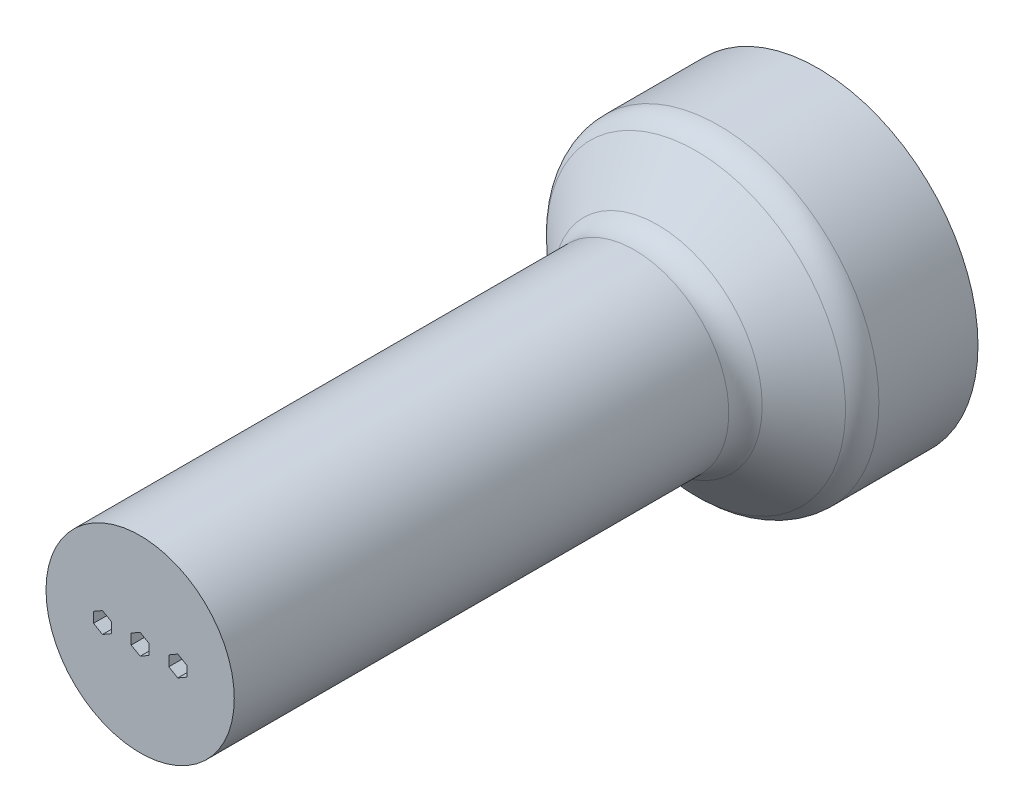
ISO-10303-21;
HEADER;
FILE_DESCRIPTION(('STEP AP214'),'2;1');
FILE_NAME('part.step','',(''),(''),'','','');
FILE_SCHEMA(('AUTOMOTIVE_DESIGN { 1 0 10303 214 1 1 1 1 }'));
ENDSEC;
DATA;
#1=APPLICATION_CONTEXT('core data for automotive mechanical design processes');
#2=APPLICATION_PROTOCOL_DEFINITION('international standard','automotive_design',2000,#1);
#3=PRODUCT_CONTEXT('',#1,'mechanical');
#4=PRODUCT('Part','Part','',(#3));
#5=PRODUCT_RELATED_PRODUCT_CATEGORY('part','',(#4));
#6=PRODUCT_DEFINITION_FORMATION('','',#4);
#7=PRODUCT_DEFINITION_CONTEXT('part definition',#1,'design');
#8=PRODUCT_DEFINITION('design','',#6,#7);
#9=PRODUCT_DEFINITION_SHAPE('','',#8);
#10=(LENGTH_UNIT() NAMED_UNIT(*) SI_UNIT(.MILLI.,.METRE.));
#11=(NAMED_UNIT(*) PLANE_ANGLE_UNIT() SI_UNIT($,.RADIAN.));
#12=(NAMED_UNIT(*) SI_UNIT($,.STERADIAN.) SOLID_ANGLE_UNIT());
#13=UNCERTAINTY_MEASURE_WITH_UNIT(LENGTH_MEASURE(1.E-05),#10,'distance_accuracy_value','');
#14=(GEOMETRIC_REPRESENTATION_CONTEXT(3) GLOBAL_UNCERTAINTY_ASSIGNED_CONTEXT((#13)) GLOBAL_UNIT_ASSIGNED_CONTEXT((#10,
#11,#12)) REPRESENTATION_CONTEXT('',''));
#15=CARTESIAN_POINT('',(0.,0.,0.));
#16=DIRECTION('',(0.,0.,1.));
#17=DIRECTION('',(1.,0.,0.));
#18=AXIS2_PLACEMENT_3D('',#15,#16,#17);
#19=CARTESIAN_POINT('',(0.,0.,-30.));
#20=DIRECTION('',(0.,0.,1.));
#21=DIRECTION('',(1.,0.,0.));
#22=AXIS2_PLACEMENT_3D('',#19,#20,#21);
#23=PLANE('',#22);
#24=CARTESIAN_POINT('',(-30.,0.,-30.));
#25=DIRECTION('',(0.,0.,-1.));
#26=DIRECTION('',(-1.,0.,0.));
#27=AXIS2_PLACEMENT_3D('',#24,#25,#26);
#28=CIRCLE('',#27,10.);
#29=CARTESIAN_POINT('',(-40.,0.,-30.));
#30=VERTEX_POINT('',#29);
#31=EDGE_CURVE('E460',#30,#30,#28,.T.);
#32=ORIENTED_EDGE('',*,*,#31,.F.);
#33=EDGE_LOOP('',(#32));
#34=FACE_BOUND('',#33,.T.);
#35=CARTESIAN_POINT('',(10.,0.,-30.));
#36=DIRECTION('',(0.,0.,1.));
#37=DIRECTION('',(1.,0.,0.));
#38=AXIS2_PLACEMENT_3D('',#35,#36,#37);
#39=CIRCLE('',#38,1.6);
#40=CARTESIAN_POINT('',(11.6,0.,-30.));
#41=VERTEX_POINT('',#40);
#42=EDGE_CURVE('E359',#41,#41,#39,.F.);
#43=ORIENTED_EDGE('',*,*,#42,.F.);
#44=EDGE_LOOP('',(#43));
#45=FACE_BOUND('',#44,.T.);
#46=CARTESIAN_POINT('',(-10.,0.,-30.));
#47=DIRECTION('',(0.,0.,1.));
#48=DIRECTION('',(1.,0.,0.));
#49=AXIS2_PLACEMENT_3D('',#46,#47,#48);
#50=CIRCLE('',#49,1.6);
#51=CARTESIAN_POINT('',(-8.4,0.,-30.));
#52=VERTEX_POINT('',#51);
#53=EDGE_CURVE('E354',#52,#52,#50,.F.);
#54=ORIENTED_EDGE('',*,*,#53,.F.);
#55=EDGE_LOOP('',(#54));
#56=FACE_BOUND('',#55,.T.);
#57=CARTESIAN_POINT('',(0.,0.,-30.));
#58=DIRECTION('',(0.,0.,1.));
#59=DIRECTION('',(1.,0.,0.));
#60=AXIS2_PLACEMENT_3D('',#57,#58,#59);
#61=CIRCLE('',#60,1.6);
#62=CARTESIAN_POINT('',(1.6,0.,-30.));
#63=VERTEX_POINT('',#62);
#64=EDGE_CURVE('E358',#63,#63,#61,.F.);
#65=ORIENTED_EDGE('',*,*,#64,.F.);
#66=EDGE_LOOP('',(#65));
#67=FACE_BOUND('',#66,.T.);
#68=CARTESIAN_POINT('',(0.,0.,-30.));
#69=DIRECTION('',(0.,0.,1.));
#70=DIRECTION('',(1.,0.,0.));
#71=AXIS2_PLACEMENT_3D('',#68,#69,#70);
#72=CIRCLE('',#71,42.5);
#73=CARTESIAN_POINT('',(42.5,0.,-30.));
#74=VERTEX_POINT('',#73);
#75=EDGE_CURVE('E366',#74,#74,#72,.T.);
#76=ORIENTED_EDGE('',*,*,#75,.F.);
#77=EDGE_LOOP('',(#76));
#78=FACE_BOUND('',#77,.T.);
#79=CARTESIAN_POINT('',(30.,0.,-30.));
#80=DIRECTION('',(0.,0.,1.));
#81=DIRECTION('',(1.,0.,0.));
#82=AXIS2_PLACEMENT_3D('',#79,#80,#81);
#83=CIRCLE('',#82,10.);
#84=CARTESIAN_POINT('',(40.,0.,-30.));
#85=VERTEX_POINT('',#84);
#86=EDGE_CURVE('E457',#85,#85,#83,.T.);
#87=ORIENTED_EDGE('',*,*,#86,.T.);
#88=EDGE_LOOP('',(#87));
#89=FACE_BOUND('',#88,.T.);
#90=ADVANCED_FACE('F41',(#34,#45,#56,#67,#78,#89),#23,.F.);
#91=CARTESIAN_POINT('',(0.,0.,-34.5254833995939));
#92=DIRECTION('',(0.,0.,1.));
#93=DIRECTION('',(1.,0.,0.));
#94=AXIS2_PLACEMENT_3D('',#91,#92,#93);
#95=CYLINDRICAL_SURFACE('',#94,1.6);
#96=ORIENTED_EDGE('',*,*,#64,.T.);
#97=EDGE_LOOP('',(#96));
#98=FACE_BOUND('',#97,.T.);
#99=CARTESIAN_POINT('',(0.,0.,-5.));
#100=DIRECTION('',(0.,0.,1.));
#101=DIRECTION('',(1.,0.,0.));
#102=AXIS2_PLACEMENT_3D('',#99,#100,#101);
#103=CIRCLE('',#102,1.6);
#104=CARTESIAN_POINT('',(1.6,0.,-5.));
#105=VERTEX_POINT('',#104);
#106=EDGE_CURVE('E45',#105,#105,#103,.F.);
#107=ORIENTED_EDGE('',*,*,#106,.F.);
#108=EDGE_LOOP('',(#107));
#109=FACE_BOUND('',#108,.T.);
#110=ADVANCED_FACE('F398',(#98,#109),#95,.F.);
#111=CARTESIAN_POINT('',(-10.,0.,-34.5254833995939));
#112=DIRECTION('',(0.,0.,1.));
#113=DIRECTION('',(1.,0.,0.));
#114=AXIS2_PLACEMENT_3D('',#111,#112,#113);
#115=CYLINDRICAL_SURFACE('',#114,1.6);
#116=ORIENTED_EDGE('',*,*,#53,.T.);
#117=EDGE_LOOP('',(#116));
#118=FACE_BOUND('',#117,.T.);
#119=CARTESIAN_POINT('',(-10.,0.,-5.));
#120=DIRECTION('',(0.,0.,1.));
#121=DIRECTION('',(1.,0.,0.));
#122=AXIS2_PLACEMENT_3D('',#119,#120,#121);
#123=CIRCLE('',#122,1.6);
#124=CARTESIAN_POINT('',(-8.4,0.,-5.));
#125=VERTEX_POINT('',#124);
#126=EDGE_CURVE('E387',#125,#125,#123,.F.);
#127=ORIENTED_EDGE('',*,*,#126,.F.);
#128=EDGE_LOOP('',(#127));
#129=FACE_BOUND('',#128,.T.);
#130=ADVANCED_FACE('F400',(#118,#129),#115,.F.);
#131=CARTESIAN_POINT('',(10.,0.,-34.5254833995939));
#132=DIRECTION('',(0.,0.,1.));
#133=DIRECTION('',(1.,0.,0.));
#134=AXIS2_PLACEMENT_3D('',#131,#132,#133);
#135=CYLINDRICAL_SURFACE('',#134,1.6);
#136=ORIENTED_EDGE('',*,*,#42,.T.);
#137=EDGE_LOOP('',(#136));
#138=FACE_BOUND('',#137,.T.);
#139=CARTESIAN_POINT('',(10.,0.,-5.));
#140=DIRECTION('',(0.,0.,1.));
#141=DIRECTION('',(1.,0.,0.));
#142=AXIS2_PLACEMENT_3D('',#139,#140,#141);
#143=CIRCLE('',#142,1.6);
#144=CARTESIAN_POINT('',(11.6,0.,-5.));
#145=VERTEX_POINT('',#144);
#146=EDGE_CURVE('E338',#145,#145,#143,.F.);
#147=ORIENTED_EDGE('',*,*,#146,.F.);
#148=EDGE_LOOP('',(#147));
#149=FACE_BOUND('',#148,.T.);
#150=ADVANCED_FACE('F407',(#138,#149),#135,.F.);
#151=CARTESIAN_POINT('',(0.,0.,150.));
#152=DIRECTION('',(0.,0.,-1.));
#153=DIRECTION('',(-1.,0.,0.));
#154=AXIS2_PLACEMENT_3D('',#151,#152,#153);
#155=CYLINDRICAL_SURFACE('',#154,25.);
#156=CARTESIAN_POINT('',(0.,0.,18.6794793797633));
#157=DIRECTION('',(0.,0.,-1.));
#158=DIRECTION('',(-1.,0.,0.));
#159=AXIS2_PLACEMENT_3D('',#156,#157,#158);
#160=CIRCLE('',#159,25.);
#161=CARTESIAN_POINT('',(-25.,0.,18.6794793797633));
#162=VERTEX_POINT('',#161);
#163=EDGE_CURVE('E378',#162,#162,#160,.F.);
#164=ORIENTED_EDGE('',*,*,#163,.T.);
#165=EDGE_LOOP('',(#164));
#166=FACE_BOUND('',#165,.T.);
#167=CARTESIAN_POINT('',(0.,0.,150.));
#168=DIRECTION('',(0.,0.,1.));
#169=DIRECTION('',(1.,0.,0.));
#170=AXIS2_PLACEMENT_3D('',#167,#168,#169);
#171=CIRCLE('',#170,25.);
#172=CARTESIAN_POINT('',(25.,0.,150.));
#173=VERTEX_POINT('',#172);
#174=EDGE_CURVE('E370',#173,#173,#171,.T.);
#175=ORIENTED_EDGE('',*,*,#174,.F.);
#176=EDGE_LOOP('',(#175));
#177=FACE_BOUND('',#176,.T.);
#178=ADVANCED_FACE('F425',(#166,#177),#155,.T.);
#179=CARTESIAN_POINT('',(0.,0.,150.));
#180=DIRECTION('',(0.,0.,1.));
#181=DIRECTION('',(1.,0.,0.));
#182=AXIS2_PLACEMENT_3D('',#179,#180,#181);
#183=PLANE('',#182);
#184=DIRECTION('',(0.,-1.,0.));
#185=VECTOR('',#184,1.);
#186=CARTESIAN_POINT('',(-12.3815698604072,1.375,150.));
#187=LINE('',#186,#185);
#188=CARTESIAN_POINT('',(-12.3815698604072,1.375,150.));
#189=VERTEX_POINT('',#188);
#190=CARTESIAN_POINT('',(-12.3815698604072,-1.375,150.));
#191=VERTEX_POINT('',#190);
#192=EDGE_CURVE('E59',#189,#191,#187,.T.);
#193=ORIENTED_EDGE('',*,*,#192,.F.);
#194=DIRECTION('',(-0.866025403784439,-0.5,0.));
#195=VECTOR('',#194,1.);
#196=CARTESIAN_POINT('',(-10.,2.75,150.));
#197=LINE('',#196,#195);
#198=CARTESIAN_POINT('',(-10.,2.75,150.));
#199=VERTEX_POINT('',#198);
#200=EDGE_CURVE('E246',#199,#189,#197,.T.);
#201=ORIENTED_EDGE('',*,*,#200,.F.);
#202=DIRECTION('',(-0.866025403784439,0.5,0.));
#203=VECTOR('',#202,1.);
#204=CARTESIAN_POINT('',(-7.61843013959279,1.375,150.));
#205=LINE('',#204,#203);
#206=CARTESIAN_POINT('',(-7.61843013959279,1.375,150.));
#207=VERTEX_POINT('',#206);
#208=EDGE_CURVE('E250',#207,#199,#205,.T.);
#209=ORIENTED_EDGE('',*,*,#208,.F.);
#210=DIRECTION('',(0.,1.,0.));
#211=VECTOR('',#210,1.);
#212=CARTESIAN_POINT('',(-7.61843013959279,-1.375,150.));
#213=LINE('',#212,#211);
#214=CARTESIAN_POINT('',(-7.61843013959279,-1.375,150.));
#215=VERTEX_POINT('',#214);
#216=EDGE_CURVE('E255',#215,#207,#213,.T.);
#217=ORIENTED_EDGE('',*,*,#216,.F.);
#218=DIRECTION('',(0.866025403784439,0.5,0.));
#219=VECTOR('',#218,1.);
#220=CARTESIAN_POINT('',(-10.,-2.75,150.));
#221=LINE('',#220,#219);
#222=CARTESIAN_POINT('',(-10.,-2.75,150.));
#223=VERTEX_POINT('',#222);
#224=EDGE_CURVE('E259',#223,#215,#221,.T.);
#225=ORIENTED_EDGE('',*,*,#224,.F.);
#226=DIRECTION('',(0.866025403784438,-0.500000000000001,0.));
#227=VECTOR('',#226,1.);
#228=CARTESIAN_POINT('',(-12.3815698604072,-1.375,150.));
#229=LINE('',#228,#227);
#230=EDGE_CURVE('E263',#191,#223,#229,.T.);
#231=ORIENTED_EDGE('',*,*,#230,.F.);
#232=EDGE_LOOP('',(#193,#201,#209,#217,#225,#231));
#233=FACE_BOUND('',#232,.T.);
#234=DIRECTION('',(0.866025403784438,0.500000000000001,0.));
#235=VECTOR('',#234,1.);
#236=CARTESIAN_POINT('',(10.,-2.75,150.));
#237=LINE('',#236,#235);
#238=CARTESIAN_POINT('',(10.,-2.75,150.));
#239=VERTEX_POINT('',#238);
#240=CARTESIAN_POINT('',(12.3815698604072,-1.375,150.));
#241=VERTEX_POINT('',#240);
#242=EDGE_CURVE('E67',#239,#241,#237,.T.);
#243=ORIENTED_EDGE('',*,*,#242,.F.);
#244=DIRECTION('',(0.866025403784439,-0.5,0.));
#245=VECTOR('',#244,1.);
#246=CARTESIAN_POINT('',(7.6184301395928,-1.375,150.));
#247=LINE('',#246,#245);
#248=CARTESIAN_POINT('',(7.6184301395928,-1.375,150.));
#249=VERTEX_POINT('',#248);
#250=EDGE_CURVE('E179',#249,#239,#247,.T.);
#251=ORIENTED_EDGE('',*,*,#250,.F.);
#252=DIRECTION('',(0.,-1.,0.));
#253=VECTOR('',#252,1.);
#254=CARTESIAN_POINT('',(7.6184301395928,1.375,150.));
#255=LINE('',#254,#253);
#256=CARTESIAN_POINT('',(7.6184301395928,1.375,150.));
#257=VERTEX_POINT('',#256);
#258=EDGE_CURVE('E185',#257,#249,#255,.T.);
#259=ORIENTED_EDGE('',*,*,#258,.F.);
#260=DIRECTION('',(-0.866025403784439,-0.5,0.));
#261=VECTOR('',#260,1.);
#262=CARTESIAN_POINT('',(10.,2.75,150.));
#263=LINE('',#262,#261);
#264=CARTESIAN_POINT('',(10.,2.75,150.));
#265=VERTEX_POINT('',#264);
#266=EDGE_CURVE('E488',#265,#257,#263,.T.);
#267=ORIENTED_EDGE('',*,*,#266,.F.);
#268=DIRECTION('',(-0.866025403784439,0.5,0.));
#269=VECTOR('',#268,1.);
#270=CARTESIAN_POINT('',(12.3815698604072,1.375,150.));
#271=LINE('',#270,#269);
#272=CARTESIAN_POINT('',(12.3815698604072,1.375,150.));
#273=VERTEX_POINT('',#272);
#274=EDGE_CURVE('E200',#273,#265,#271,.T.);
#275=ORIENTED_EDGE('',*,*,#274,.F.);
#276=DIRECTION('',(0.,1.,0.));
#277=VECTOR('',#276,1.);
#278=CARTESIAN_POINT('',(12.3815698604072,-1.375,150.));
#279=LINE('',#278,#277);
#280=EDGE_CURVE('E192',#241,#273,#279,.T.);
#281=ORIENTED_EDGE('',*,*,#280,.F.);
#282=EDGE_LOOP('',(#243,#251,#259,#267,#275,#281));
#283=FACE_BOUND('',#282,.T.);
#284=DIRECTION('',(0.866025403784439,0.5,0.));
#285=VECTOR('',#284,1.);
#286=CARTESIAN_POINT('',(0.,-2.75,150.));
#287=LINE('',#286,#285);
#288=CARTESIAN_POINT('',(0.,-2.75,150.));
#289=VERTEX_POINT('',#288);
#290=CARTESIAN_POINT('',(2.38156986040721,-1.375,150.));
#291=VERTEX_POINT('',#290);
#292=EDGE_CURVE('E194',#289,#291,#287,.T.);
#293=ORIENTED_EDGE('',*,*,#292,.F.);
#294=DIRECTION('',(0.866025403784439,-0.5,0.));
#295=VECTOR('',#294,1.);
#296=CARTESIAN_POINT('',(-2.38156986040721,-1.375,150.));
#297=LINE('',#296,#295);
#298=CARTESIAN_POINT('',(-2.38156986040721,-1.375,150.));
#299=VERTEX_POINT('',#298);
#300=EDGE_CURVE('E296',#299,#289,#297,.T.);
#301=ORIENTED_EDGE('',*,*,#300,.F.);
#302=DIRECTION('',(0.,-1.,0.));
#303=VECTOR('',#302,1.);
#304=CARTESIAN_POINT('',(-2.38156986040721,1.375,150.));
#305=LINE('',#304,#303);
#306=CARTESIAN_POINT('',(-2.38156986040721,1.375,150.));
#307=VERTEX_POINT('',#306);
#308=EDGE_CURVE('E328',#307,#299,#305,.T.);
#309=ORIENTED_EDGE('',*,*,#308,.F.);
#310=DIRECTION('',(-0.866025403784439,-0.5,0.));
#311=VECTOR('',#310,1.);
#312=CARTESIAN_POINT('',(0.,2.75,150.));
#313=LINE('',#312,#311);
#314=CARTESIAN_POINT('',(0.,2.75,150.));
#315=VERTEX_POINT('',#314);
#316=EDGE_CURVE('E324',#315,#307,#313,.T.);
#317=ORIENTED_EDGE('',*,*,#316,.F.);
#318=DIRECTION('',(-0.866025403784439,0.5,0.));
#319=VECTOR('',#318,1.);
#320=CARTESIAN_POINT('',(2.38156986040721,1.375,150.));
#321=LINE('',#320,#319);
#322=CARTESIAN_POINT('',(2.38156986040721,1.375,150.));
#323=VERTEX_POINT('',#322);
#324=EDGE_CURVE('E320',#323,#315,#321,.T.);
#325=ORIENTED_EDGE('',*,*,#324,.F.);
#326=DIRECTION('',(0.,1.,0.));
#327=VECTOR('',#326,1.);
#328=CARTESIAN_POINT('',(2.38156986040721,-1.375,150.));
#329=LINE('',#328,#327);
#330=EDGE_CURVE('E198',#291,#323,#329,.T.);
#331=ORIENTED_EDGE('',*,*,#330,.F.);
#332=EDGE_LOOP('',(#293,#301,#309,#317,#325,#331));
#333=FACE_BOUND('',#332,.T.);
#334=ORIENTED_EDGE('',*,*,#174,.T.);
#335=EDGE_LOOP('',(#334));
#336=FACE_BOUND('',#335,.T.);
#337=ADVANCED_FACE('F188',(#233,#283,#333,#336),#183,.T.);
#338=CARTESIAN_POINT('',(0.,0.,15.));
#339=DIRECTION('',(0.,0.,-1.));
#340=DIRECTION('',(-1.,0.,0.));
#341=AXIS2_PLACEMENT_3D('',#338,#339,#340);
#342=CONICAL_SURFACE('',#341,25.,0.862170054667226);
#343=CARTESIAN_POINT('',(0.,0.,2.39457343915907));
#344=DIRECTION('',(0.,0.,-1.));
#345=DIRECTION('',(-1.,0.,0.));
#346=AXIS2_PLACEMENT_3D('',#343,#344,#345);
#347=CIRCLE('',#346,39.7063309876478);
#348=CARTESIAN_POINT('',(-39.7063309876478,0.,2.39457343915907));
#349=VERTEX_POINT('',#348);
#350=EDGE_CURVE('E51',#349,#349,#347,.F.);
#351=ORIENTED_EDGE('',*,*,#350,.T.);
#352=EDGE_LOOP('',(#351));
#353=FACE_BOUND('',#352,.T.);
#354=CARTESIAN_POINT('',(0.,0.,12.6054265608409));
#355=DIRECTION('',(0.,0.,-1.));
#356=DIRECTION('',(-1.,0.,0.));
#357=AXIS2_PLACEMENT_3D('',#354,#355,#356);
#358=CIRCLE('',#357,27.7936690123523);
#359=CARTESIAN_POINT('',(-27.7936690123523,0.,12.6054265608409));
#360=VERTEX_POINT('',#359);
#361=EDGE_CURVE('E374',#360,#360,#358,.T.);
#362=ORIENTED_EDGE('',*,*,#361,.T.);
#363=EDGE_LOOP('',(#362));
#364=FACE_BOUND('',#363,.T.);
#365=ADVANCED_FACE('F414',(#353,#364),#342,.T.);
#366=CARTESIAN_POINT('',(0.,0.,-30.));
#367=DIRECTION('',(0.,0.,1.));
#368=DIRECTION('',(1.,0.,0.));
#369=AXIS2_PLACEMENT_3D('',#366,#367,#368);
#370=CYLINDRICAL_SURFACE('',#369,42.5);
#371=CARTESIAN_POINT('',(0.,0.,-3.6794793797633));
#372=DIRECTION('',(0.,0.,-1.));
#373=DIRECTION('',(-1.,0.,0.));
#374=AXIS2_PLACEMENT_3D('',#371,#372,#373);
#375=CIRCLE('',#374,42.5);
#376=CARTESIAN_POINT('',(-42.5,0.,-3.6794793797633));
#377=VERTEX_POINT('',#376);
#378=EDGE_CURVE('E11',#377,#377,#375,.T.);
#379=ORIENTED_EDGE('',*,*,#378,.T.);
#380=EDGE_LOOP('',(#379));
#381=FACE_BOUND('',#380,.T.);
#382=ORIENTED_EDGE('',*,*,#75,.T.);
#383=EDGE_LOOP('',(#382));
#384=FACE_BOUND('',#383,.T.);
#385=ADVANCED_FACE('F416',(#381,#384),#370,.T.);
#386=CARTESIAN_POINT('',(0.,0.,18.6794793797633));
#387=DIRECTION('',(0.,0.,-1.));
#388=DIRECTION('',(-1.,0.,0.));
#389=AXIS2_PLACEMENT_3D('',#386,#387,#388);
#390=TOROIDAL_SURFACE('',#389,33.,8.);
#391=ORIENTED_EDGE('',*,*,#163,.F.);
#392=EDGE_LOOP('',(#391));
#393=FACE_BOUND('',#392,.T.);
#394=ORIENTED_EDGE('',*,*,#361,.F.);
#395=EDGE_LOOP('',(#394));
#396=FACE_BOUND('',#395,.T.);
#397=ADVANCED_FACE('F421',(#393,#396),#390,.F.);
#398=CARTESIAN_POINT('',(0.,0.,-3.6794793797633));
#399=DIRECTION('',(0.,0.,-1.));
#400=DIRECTION('',(-1.,0.,0.));
#401=AXIS2_PLACEMENT_3D('',#398,#399,#400);
#402=TOROIDAL_SURFACE('',#401,34.5,8.);
#403=ORIENTED_EDGE('',*,*,#378,.F.);
#404=EDGE_LOOP('',(#403));
#405=FACE_BOUND('',#404,.T.);
#406=ORIENTED_EDGE('',*,*,#350,.F.);
#407=EDGE_LOOP('',(#406));
#408=FACE_BOUND('',#407,.T.);
#409=ADVANCED_FACE('F43',(#405,#408),#402,.T.);
#410=CARTESIAN_POINT('',(0.,0.,-5.));
#411=DIRECTION('',(0.,0.,1.));
#412=DIRECTION('',(1.,0.,0.));
#413=AXIS2_PLACEMENT_3D('',#410,#411,#412);
#414=PLANE('',#413);
#415=DIRECTION('',(0.866025403784438,0.500000000000001,0.));
#416=VECTOR('',#415,1.);
#417=CARTESIAN_POINT('',(10.,-2.75,-5.));
#418=LINE('',#417,#416);
#419=CARTESIAN_POINT('',(10.,-2.75,-5.));
#420=VERTEX_POINT('',#419);
#421=CARTESIAN_POINT('',(12.3815698604072,-1.375,-5.));
#422=VERTEX_POINT('',#421);
#423=EDGE_CURVE('E171',#420,#422,#418,.T.);
#424=ORIENTED_EDGE('',*,*,#423,.T.);
#425=DIRECTION('',(0.,1.,0.));
#426=VECTOR('',#425,1.);
#427=CARTESIAN_POINT('',(12.3815698604072,-1.375,-5.));
#428=LINE('',#427,#426);
#429=CARTESIAN_POINT('',(12.3815698604072,1.375,-5.));
#430=VERTEX_POINT('',#429);
#431=EDGE_CURVE('E220',#422,#430,#428,.T.);
#432=ORIENTED_EDGE('',*,*,#431,.T.);
#433=DIRECTION('',(-0.866025403784439,0.5,0.));
#434=VECTOR('',#433,1.);
#435=CARTESIAN_POINT('',(12.3815698604072,1.375,-5.));
#436=LINE('',#435,#434);
#437=CARTESIAN_POINT('',(10.,2.75,-5.));
#438=VERTEX_POINT('',#437);
#439=EDGE_CURVE('E216',#430,#438,#436,.T.);
#440=ORIENTED_EDGE('',*,*,#439,.T.);
#441=DIRECTION('',(-0.866025403784439,-0.5,0.));
#442=VECTOR('',#441,1.);
#443=CARTESIAN_POINT('',(10.,2.75,-5.));
#444=LINE('',#443,#442);
#445=CARTESIAN_POINT('',(7.6184301395928,1.375,-5.));
#446=VERTEX_POINT('',#445);
#447=EDGE_CURVE('E212',#438,#446,#444,.T.);
#448=ORIENTED_EDGE('',*,*,#447,.T.);
#449=DIRECTION('',(0.,-1.,0.));
#450=VECTOR('',#449,1.);
#451=CARTESIAN_POINT('',(7.6184301395928,1.375,-5.));
#452=LINE('',#451,#450);
#453=CARTESIAN_POINT('',(7.6184301395928,-1.375,-5.));
#454=VERTEX_POINT('',#453);
#455=EDGE_CURVE('E207',#446,#454,#452,.T.);
#456=ORIENTED_EDGE('',*,*,#455,.T.);
#457=DIRECTION('',(0.866025403784439,-0.5,0.));
#458=VECTOR('',#457,1.);
#459=CARTESIAN_POINT('',(7.6184301395928,-1.375,-5.));
#460=LINE('',#459,#458);
#461=EDGE_CURVE('E204',#454,#420,#460,.T.);
#462=ORIENTED_EDGE('',*,*,#461,.T.);
#463=EDGE_LOOP('',(#424,#432,#440,#448,#456,#462));
#464=FACE_BOUND('',#463,.T.);
#465=ORIENTED_EDGE('',*,*,#146,.T.);
#466=EDGE_LOOP('',(#465));
#467=FACE_BOUND('',#466,.T.);
#468=ADVANCED_FACE('F434',(#464,#467),#414,.T.);
#469=CARTESIAN_POINT('',(10.,-2.75,-5.));
#470=DIRECTION('',(0.500000000000001,-0.866025403784438,0.));
#471=DIRECTION('',(0.866025403784438,0.500000000000001,0.));
#472=AXIS2_PLACEMENT_3D('',#469,#470,#471);
#473=PLANE('',#472);
#474=ORIENTED_EDGE('',*,*,#242,.T.);
#475=DIRECTION('',(0.,0.,1.));
#476=VECTOR('',#475,1.);
#477=CARTESIAN_POINT('',(12.3815698604072,-1.375,-5.));
#478=LINE('',#477,#476);
#479=EDGE_CURVE('E208',#422,#241,#478,.T.);
#480=ORIENTED_EDGE('',*,*,#479,.F.);
#481=ORIENTED_EDGE('',*,*,#423,.F.);
#482=DIRECTION('',(0.,0.,1.));
#483=VECTOR('',#482,1.);
#484=CARTESIAN_POINT('',(10.,-2.75,-5.));
#485=LINE('',#484,#483);
#486=EDGE_CURVE('E167',#420,#239,#485,.T.);
#487=ORIENTED_EDGE('',*,*,#486,.T.);
#488=EDGE_LOOP('',(#474,#480,#481,#487));
#489=FACE_BOUND('',#488,.T.);
#490=ADVANCED_FACE('F169',(#489),#473,.F.);
#491=CARTESIAN_POINT('',(7.6184301395928,-1.375,-5.));
#492=DIRECTION('',(-0.5,-0.866025403784439,0.));
#493=DIRECTION('',(0.866025403784439,-0.5,0.));
#494=AXIS2_PLACEMENT_3D('',#491,#492,#493);
#495=PLANE('',#494);
#496=ORIENTED_EDGE('',*,*,#250,.T.);
#497=ORIENTED_EDGE('',*,*,#486,.F.);
#498=ORIENTED_EDGE('',*,*,#461,.F.);
#499=DIRECTION('',(0.,0.,1.));
#500=VECTOR('',#499,1.);
#501=CARTESIAN_POINT('',(7.6184301395928,-1.375,-5.));
#502=LINE('',#501,#500);
#503=EDGE_CURVE('E176',#454,#249,#502,.T.);
#504=ORIENTED_EDGE('',*,*,#503,.T.);
#505=EDGE_LOOP('',(#496,#497,#498,#504));
#506=FACE_BOUND('',#505,.T.);
#507=ADVANCED_FACE('F180',(#506),#495,.F.);
#508=CARTESIAN_POINT('',(7.6184301395928,1.375,-5.));
#509=DIRECTION('',(-1.,0.,0.));
#510=DIRECTION('',(0.,-1.,0.));
#511=AXIS2_PLACEMENT_3D('',#508,#509,#510);
#512=PLANE('',#511);
#513=ORIENTED_EDGE('',*,*,#258,.T.);
#514=ORIENTED_EDGE('',*,*,#503,.F.);
#515=ORIENTED_EDGE('',*,*,#455,.F.);
#516=DIRECTION('',(0.,0.,1.));
#517=VECTOR('',#516,1.);
#518=CARTESIAN_POINT('',(7.6184301395928,1.375,-5.));
#519=LINE('',#518,#517);
#520=EDGE_CURVE('E481',#446,#257,#519,.T.);
#521=ORIENTED_EDGE('',*,*,#520,.T.);
#522=EDGE_LOOP('',(#513,#514,#515,#521));
#523=FACE_BOUND('',#522,.T.);
#524=ADVANCED_FACE('F521',(#523),#512,.F.);
#525=CARTESIAN_POINT('',(10.,2.75,-5.));
#526=DIRECTION('',(-0.5,0.866025403784439,0.));
#527=DIRECTION('',(-0.866025403784438,-0.5,0.));
#528=AXIS2_PLACEMENT_3D('',#525,#526,#527);
#529=PLANE('',#528);
#530=ORIENTED_EDGE('',*,*,#266,.T.);
#531=ORIENTED_EDGE('',*,*,#520,.F.);
#532=ORIENTED_EDGE('',*,*,#447,.F.);
#533=DIRECTION('',(0.,0.,1.));
#534=VECTOR('',#533,1.);
#535=CARTESIAN_POINT('',(10.,2.75,-5.));
#536=LINE('',#535,#534);
#537=EDGE_CURVE('E478',#438,#265,#536,.T.);
#538=ORIENTED_EDGE('',*,*,#537,.T.);
#539=EDGE_LOOP('',(#530,#531,#532,#538));
#540=FACE_BOUND('',#539,.T.);
#541=ADVANCED_FACE('F499',(#540),#529,.F.);
#542=CARTESIAN_POINT('',(12.3815698604072,1.375,-5.));
#543=DIRECTION('',(0.5,0.866025403784439,0.));
#544=DIRECTION('',(-0.866025403784438,0.5,0.));
#545=AXIS2_PLACEMENT_3D('',#542,#543,#544);
#546=PLANE('',#545);
#547=ORIENTED_EDGE('',*,*,#274,.T.);
#548=ORIENTED_EDGE('',*,*,#537,.F.);
#549=ORIENTED_EDGE('',*,*,#439,.F.);
#550=DIRECTION('',(0.,0.,1.));
#551=VECTOR('',#550,1.);
#552=CARTESIAN_POINT('',(12.3815698604072,1.375,-5.));
#553=LINE('',#552,#551);
#554=EDGE_CURVE('E475',#430,#273,#553,.T.);
#555=ORIENTED_EDGE('',*,*,#554,.T.);
#556=EDGE_LOOP('',(#547,#548,#549,#555));
#557=FACE_BOUND('',#556,.T.);
#558=ADVANCED_FACE('F495',(#557),#546,.F.);
#559=CARTESIAN_POINT('',(12.3815698604072,-1.375,-5.));
#560=DIRECTION('',(1.,0.,0.));
#561=DIRECTION('',(0.,1.,0.));
#562=AXIS2_PLACEMENT_3D('',#559,#560,#561);
#563=PLANE('',#562);
#564=ORIENTED_EDGE('',*,*,#280,.T.);
#565=ORIENTED_EDGE('',*,*,#554,.F.);
#566=ORIENTED_EDGE('',*,*,#431,.F.);
#567=ORIENTED_EDGE('',*,*,#479,.T.);
#568=EDGE_LOOP('',(#564,#565,#566,#567));
#569=FACE_BOUND('',#568,.T.);
#570=ADVANCED_FACE('F504',(#569),#563,.F.);
#571=CARTESIAN_POINT('',(0.,0.,-5.));
#572=DIRECTION('',(0.,0.,1.));
#573=DIRECTION('',(1.,0.,0.));
#574=AXIS2_PLACEMENT_3D('',#571,#572,#573);
#575=PLANE('',#574);
#576=DIRECTION('',(0.,-1.,0.));
#577=VECTOR('',#576,1.);
#578=CARTESIAN_POINT('',(-12.3815698604072,1.375,-5.));
#579=LINE('',#578,#577);
#580=CARTESIAN_POINT('',(-12.3815698604072,1.375,-5.));
#581=VERTEX_POINT('',#580);
#582=CARTESIAN_POINT('',(-12.3815698604072,-1.375,-5.));
#583=VERTEX_POINT('',#582);
#584=EDGE_CURVE('E251',#581,#583,#579,.T.);
#585=ORIENTED_EDGE('',*,*,#584,.T.);
#586=DIRECTION('',(0.866025403784438,-0.500000000000001,0.));
#587=VECTOR('',#586,1.);
#588=CARTESIAN_POINT('',(-12.3815698604072,-1.375,-5.));
#589=LINE('',#588,#587);
#590=CARTESIAN_POINT('',(-10.,-2.75,-5.));
#591=VERTEX_POINT('',#590);
#592=EDGE_CURVE('E284',#583,#591,#589,.T.);
#593=ORIENTED_EDGE('',*,*,#592,.T.);
#594=DIRECTION('',(0.866025403784439,0.5,0.));
#595=VECTOR('',#594,1.);
#596=CARTESIAN_POINT('',(-10.,-2.75,-5.));
#597=LINE('',#596,#595);
#598=CARTESIAN_POINT('',(-7.61843013959279,-1.375,-5.));
#599=VERTEX_POINT('',#598);
#600=EDGE_CURVE('E280',#591,#599,#597,.T.);
#601=ORIENTED_EDGE('',*,*,#600,.T.);
#602=DIRECTION('',(0.,1.,0.));
#603=VECTOR('',#602,1.);
#604=CARTESIAN_POINT('',(-7.61843013959279,-1.375,-5.));
#605=LINE('',#604,#603);
#606=CARTESIAN_POINT('',(-7.61843013959279,1.375,-5.));
#607=VERTEX_POINT('',#606);
#608=EDGE_CURVE('E276',#599,#607,#605,.T.);
#609=ORIENTED_EDGE('',*,*,#608,.T.);
#610=DIRECTION('',(-0.866025403784439,0.5,0.));
#611=VECTOR('',#610,1.);
#612=CARTESIAN_POINT('',(-7.61843013959279,1.375,-5.));
#613=LINE('',#612,#611);
#614=CARTESIAN_POINT('',(-10.,2.75,-5.));
#615=VERTEX_POINT('',#614);
#616=EDGE_CURVE('E272',#607,#615,#613,.T.);
#617=ORIENTED_EDGE('',*,*,#616,.T.);
#618=DIRECTION('',(-0.866025403784439,-0.5,0.));
#619=VECTOR('',#618,1.);
#620=CARTESIAN_POINT('',(-10.,2.75,-5.));
#621=LINE('',#620,#619);
#622=EDGE_CURVE('E229',#615,#581,#621,.T.);
#623=ORIENTED_EDGE('',*,*,#622,.T.);
#624=EDGE_LOOP('',(#585,#593,#601,#609,#617,#623));
#625=FACE_BOUND('',#624,.T.);
#626=ORIENTED_EDGE('',*,*,#126,.T.);
#627=EDGE_LOOP('',(#626));
#628=FACE_BOUND('',#627,.T.);
#629=ADVANCED_FACE('F506',(#625,#628),#575,.T.);
#630=CARTESIAN_POINT('',(-12.3815698604072,1.375,-5.));
#631=DIRECTION('',(-1.,0.,0.));
#632=DIRECTION('',(0.,0.,1.));
#633=AXIS2_PLACEMENT_3D('',#630,#631,#632);
#634=PLANE('',#633);
#635=ORIENTED_EDGE('',*,*,#192,.T.);
#636=DIRECTION('',(0.,0.,1.));
#637=VECTOR('',#636,1.);
#638=CARTESIAN_POINT('',(-12.3815698604072,-1.375,-5.));
#639=LINE('',#638,#637);
#640=EDGE_CURVE('E226',#583,#191,#639,.T.);
#641=ORIENTED_EDGE('',*,*,#640,.F.);
#642=ORIENTED_EDGE('',*,*,#584,.F.);
#643=DIRECTION('',(0.,0.,1.));
#644=VECTOR('',#643,1.);
#645=CARTESIAN_POINT('',(-12.3815698604072,1.375,-5.));
#646=LINE('',#645,#644);
#647=EDGE_CURVE('E242',#581,#189,#646,.T.);
#648=ORIENTED_EDGE('',*,*,#647,.T.);
#649=EDGE_LOOP('',(#635,#641,#642,#648));
#650=FACE_BOUND('',#649,.T.);
#651=ADVANCED_FACE('F512',(#650),#634,.F.);
#652=CARTESIAN_POINT('',(-10.,2.75,-5.));
#653=DIRECTION('',(-0.5,0.866025403784439,0.));
#654=DIRECTION('',(-0.866025403784439,-0.5,0.));
#655=AXIS2_PLACEMENT_3D('',#652,#653,#654);
#656=PLANE('',#655);
#657=ORIENTED_EDGE('',*,*,#200,.T.);
#658=ORIENTED_EDGE('',*,*,#647,.F.);
#659=ORIENTED_EDGE('',*,*,#622,.F.);
#660=DIRECTION('',(0.,0.,1.));
#661=VECTOR('',#660,1.);
#662=CARTESIAN_POINT('',(-10.,2.75,-5.));
#663=LINE('',#662,#661);
#664=EDGE_CURVE('E239',#615,#199,#663,.T.);
#665=ORIENTED_EDGE('',*,*,#664,.T.);
#666=EDGE_LOOP('',(#657,#658,#659,#665));
#667=FACE_BOUND('',#666,.T.);
#668=ADVANCED_FACE('F529',(#667),#656,.F.);
#669=CARTESIAN_POINT('',(-7.61843013959279,1.375,-5.));
#670=DIRECTION('',(0.5,0.866025403784439,0.));
#671=DIRECTION('',(-0.866025403784438,0.5,0.));
#672=AXIS2_PLACEMENT_3D('',#669,#670,#671);
#673=PLANE('',#672);
#674=ORIENTED_EDGE('',*,*,#208,.T.);
#675=ORIENTED_EDGE('',*,*,#664,.F.);
#676=ORIENTED_EDGE('',*,*,#616,.F.);
#677=DIRECTION('',(0.,0.,1.));
#678=VECTOR('',#677,1.);
#679=CARTESIAN_POINT('',(-7.61843013959279,1.375,-5.));
#680=LINE('',#679,#678);
#681=EDGE_CURVE('E236',#607,#207,#680,.T.);
#682=ORIENTED_EDGE('',*,*,#681,.T.);
#683=EDGE_LOOP('',(#674,#675,#676,#682));
#684=FACE_BOUND('',#683,.T.);
#685=ADVANCED_FACE('F541',(#684),#673,.F.);
#686=CARTESIAN_POINT('',(-7.61843013959279,-1.375,-5.));
#687=DIRECTION('',(1.,0.,0.));
#688=DIRECTION('',(0.,0.,-1.));
#689=AXIS2_PLACEMENT_3D('',#686,#687,#688);
#690=PLANE('',#689);
#691=ORIENTED_EDGE('',*,*,#216,.T.);
#692=ORIENTED_EDGE('',*,*,#681,.F.);
#693=ORIENTED_EDGE('',*,*,#608,.F.);
#694=DIRECTION('',(0.,0.,1.));
#695=VECTOR('',#694,1.);
#696=CARTESIAN_POINT('',(-7.61843013959279,-1.375,-5.));
#697=LINE('',#696,#695);
#698=EDGE_CURVE('E233',#599,#215,#697,.T.);
#699=ORIENTED_EDGE('',*,*,#698,.T.);
#700=EDGE_LOOP('',(#691,#692,#693,#699));
#701=FACE_BOUND('',#700,.T.);
#702=ADVANCED_FACE('F537',(#701),#690,.F.);
#703=CARTESIAN_POINT('',(-10.,-2.75,-5.));
#704=DIRECTION('',(0.5,-0.866025403784439,0.));
#705=DIRECTION('',(0.866025403784439,0.5,0.));
#706=AXIS2_PLACEMENT_3D('',#703,#704,#705);
#707=PLANE('',#706);
#708=ORIENTED_EDGE('',*,*,#224,.T.);
#709=ORIENTED_EDGE('',*,*,#698,.F.);
#710=ORIENTED_EDGE('',*,*,#600,.F.);
#711=DIRECTION('',(0.,0.,1.));
#712=VECTOR('',#711,1.);
#713=CARTESIAN_POINT('',(-10.,-2.75,-5.));
#714=LINE('',#713,#712);
#715=EDGE_CURVE('E230',#591,#223,#714,.T.);
#716=ORIENTED_EDGE('',*,*,#715,.T.);
#717=EDGE_LOOP('',(#708,#709,#710,#716));
#718=FACE_BOUND('',#717,.T.);
#719=ADVANCED_FACE('F533',(#718),#707,.F.);
#720=CARTESIAN_POINT('',(-12.3815698604072,-1.375,-5.));
#721=DIRECTION('',(-0.500000000000001,-0.866025403784438,0.));
#722=DIRECTION('',(0.866025403784438,-0.500000000000001,0.));
#723=AXIS2_PLACEMENT_3D('',#720,#721,#722);
#724=PLANE('',#723);
#725=ORIENTED_EDGE('',*,*,#230,.T.);
#726=ORIENTED_EDGE('',*,*,#715,.F.);
#727=ORIENTED_EDGE('',*,*,#592,.F.);
#728=ORIENTED_EDGE('',*,*,#640,.T.);
#729=EDGE_LOOP('',(#725,#726,#727,#728));
#730=FACE_BOUND('',#729,.T.);
#731=ADVANCED_FACE('F530',(#730),#724,.F.);
#732=CARTESIAN_POINT('',(0.,0.,-5.));
#733=DIRECTION('',(0.,0.,1.));
#734=DIRECTION('',(1.,0.,0.));
#735=AXIS2_PLACEMENT_3D('',#732,#733,#734);
#736=PLANE('',#735);
#737=DIRECTION('',(0.866025403784439,0.5,0.));
#738=VECTOR('',#737,1.);
#739=CARTESIAN_POINT('',(0.,-2.75,-5.));
#740=LINE('',#739,#738);
#741=CARTESIAN_POINT('',(0.,-2.75,-5.));
#742=VERTEX_POINT('',#741);
#743=CARTESIAN_POINT('',(2.38156986040721,-1.375,-5.));
#744=VERTEX_POINT('',#743);
#745=EDGE_CURVE('E291',#742,#744,#740,.T.);
#746=ORIENTED_EDGE('',*,*,#745,.T.);
#747=DIRECTION('',(0.,1.,0.));
#748=VECTOR('',#747,1.);
#749=CARTESIAN_POINT('',(2.38156986040721,-1.375,-5.));
#750=LINE('',#749,#748);
#751=CARTESIAN_POINT('',(2.38156986040721,1.375,-5.));
#752=VERTEX_POINT('',#751);
#753=EDGE_CURVE('E295',#744,#752,#750,.T.);
#754=ORIENTED_EDGE('',*,*,#753,.T.);
#755=DIRECTION('',(-0.866025403784439,0.5,0.));
#756=VECTOR('',#755,1.);
#757=CARTESIAN_POINT('',(2.38156986040721,1.375,-5.));
#758=LINE('',#757,#756);
#759=CARTESIAN_POINT('',(0.,2.75,-5.));
#760=VERTEX_POINT('',#759);
#761=EDGE_CURVE('E300',#752,#760,#758,.T.);
#762=ORIENTED_EDGE('',*,*,#761,.T.);
#763=DIRECTION('',(-0.866025403784439,-0.5,0.));
#764=VECTOR('',#763,1.);
#765=CARTESIAN_POINT('',(0.,2.75,-5.));
#766=LINE('',#765,#764);
#767=CARTESIAN_POINT('',(-2.38156986040721,1.375,-5.));
#768=VERTEX_POINT('',#767);
#769=EDGE_CURVE('E304',#760,#768,#766,.T.);
#770=ORIENTED_EDGE('',*,*,#769,.T.);
#771=DIRECTION('',(0.,-1.,0.));
#772=VECTOR('',#771,1.);
#773=CARTESIAN_POINT('',(-2.38156986040721,1.375,-5.));
#774=LINE('',#773,#772);
#775=CARTESIAN_POINT('',(-2.38156986040721,-1.375,-5.));
#776=VERTEX_POINT('',#775);
#777=EDGE_CURVE('E308',#768,#776,#774,.T.);
#778=ORIENTED_EDGE('',*,*,#777,.T.);
#779=DIRECTION('',(0.866025403784439,-0.5,0.));
#780=VECTOR('',#779,1.);
#781=CARTESIAN_POINT('',(-2.38156986040721,-1.375,-5.));
#782=LINE('',#781,#780);
#783=EDGE_CURVE('E312',#776,#742,#782,.T.);
#784=ORIENTED_EDGE('',*,*,#783,.T.);
#785=EDGE_LOOP('',(#746,#754,#762,#770,#778,#784));
#786=FACE_BOUND('',#785,.T.);
#787=ORIENTED_EDGE('',*,*,#106,.T.);
#788=EDGE_LOOP('',(#787));
#789=FACE_BOUND('',#788,.T.);
#790=ADVANCED_FACE('F396',(#786,#789),#736,.T.);
#791=CARTESIAN_POINT('',(0.,-2.75,-5.));
#792=DIRECTION('',(0.5,-0.866025403784439,0.));
#793=DIRECTION('',(0.866025403784438,0.5,0.));
#794=AXIS2_PLACEMENT_3D('',#791,#792,#793);
#795=PLANE('',#794);
#796=ORIENTED_EDGE('',*,*,#292,.T.);
#797=DIRECTION('',(0.,0.,1.));
#798=VECTOR('',#797,1.);
#799=CARTESIAN_POINT('',(2.38156986040721,-1.375,-5.));
#800=LINE('',#799,#798);
#801=EDGE_CURVE('E315',#744,#291,#800,.T.);
#802=ORIENTED_EDGE('',*,*,#801,.F.);
#803=ORIENTED_EDGE('',*,*,#745,.F.);
#804=DIRECTION('',(0.,0.,1.));
#805=VECTOR('',#804,1.);
#806=CARTESIAN_POINT('',(0.,-2.75,-5.));
#807=LINE('',#806,#805);
#808=EDGE_CURVE('E335',#742,#289,#807,.T.);
#809=ORIENTED_EDGE('',*,*,#808,.T.);
#810=EDGE_LOOP('',(#796,#802,#803,#809));
#811=FACE_BOUND('',#810,.T.);
#812=ADVANCED_FACE('F551',(#811),#795,.F.);
#813=CARTESIAN_POINT('',(-2.38156986040721,-1.375,-5.));
#814=DIRECTION('',(-0.5,-0.866025403784439,0.));
#815=DIRECTION('',(0.866025403784439,-0.5,0.));
#816=AXIS2_PLACEMENT_3D('',#813,#814,#815);
#817=PLANE('',#816);
#818=ORIENTED_EDGE('',*,*,#300,.T.);
#819=ORIENTED_EDGE('',*,*,#808,.F.);
#820=ORIENTED_EDGE('',*,*,#783,.F.);
#821=DIRECTION('',(0.,0.,1.));
#822=VECTOR('',#821,1.);
#823=CARTESIAN_POINT('',(-2.38156986040721,-1.375,-5.));
#824=LINE('',#823,#822);
#825=EDGE_CURVE('E339',#776,#299,#824,.T.);
#826=ORIENTED_EDGE('',*,*,#825,.T.);
#827=EDGE_LOOP('',(#818,#819,#820,#826));
#828=FACE_BOUND('',#827,.T.);
#829=ADVANCED_FACE('F553',(#828),#817,.F.);
#830=CARTESIAN_POINT('',(-2.38156986040721,1.375,-5.));
#831=DIRECTION('',(-1.,0.,0.));
#832=DIRECTION('',(0.,0.,1.));
#833=AXIS2_PLACEMENT_3D('',#830,#831,#832);
#834=PLANE('',#833);
#835=ORIENTED_EDGE('',*,*,#308,.T.);
#836=ORIENTED_EDGE('',*,*,#825,.F.);
#837=ORIENTED_EDGE('',*,*,#777,.F.);
#838=DIRECTION('',(0.,0.,1.));
#839=VECTOR('',#838,1.);
#840=CARTESIAN_POINT('',(-2.38156986040721,1.375,-5.));
#841=LINE('',#840,#839);
#842=EDGE_CURVE('E342',#768,#307,#841,.T.);
#843=ORIENTED_EDGE('',*,*,#842,.T.);
#844=EDGE_LOOP('',(#835,#836,#837,#843));
#845=FACE_BOUND('',#844,.T.);
#846=ADVANCED_FACE('F556',(#845),#834,.F.);
#847=CARTESIAN_POINT('',(0.,2.75,-5.));
#848=DIRECTION('',(-0.5,0.866025403784439,0.));
#849=DIRECTION('',(-0.866025403784439,-0.5,0.));
#850=AXIS2_PLACEMENT_3D('',#847,#848,#849);
#851=PLANE('',#850);
#852=ORIENTED_EDGE('',*,*,#316,.T.);
#853=ORIENTED_EDGE('',*,*,#842,.F.);
#854=ORIENTED_EDGE('',*,*,#769,.F.);
#855=DIRECTION('',(0.,0.,1.));
#856=VECTOR('',#855,1.);
#857=CARTESIAN_POINT('',(0.,2.75,-5.));
#858=LINE('',#857,#856);
#859=EDGE_CURVE('E345',#760,#315,#858,.T.);
#860=ORIENTED_EDGE('',*,*,#859,.T.);
#861=EDGE_LOOP('',(#852,#853,#854,#860));
#862=FACE_BOUND('',#861,.T.);
#863=ADVANCED_FACE('F560',(#862),#851,.F.);
#864=CARTESIAN_POINT('',(2.38156986040721,1.375,-5.));
#865=DIRECTION('',(0.5,0.866025403784439,0.));
#866=DIRECTION('',(-0.866025403784439,0.5,0.));
#867=AXIS2_PLACEMENT_3D('',#864,#865,#866);
#868=PLANE('',#867);
#869=ORIENTED_EDGE('',*,*,#324,.T.);
#870=ORIENTED_EDGE('',*,*,#859,.F.);
#871=ORIENTED_EDGE('',*,*,#761,.F.);
#872=DIRECTION('',(0.,0.,1.));
#873=VECTOR('',#872,1.);
#874=CARTESIAN_POINT('',(2.38156986040721,1.375,-5.));
#875=LINE('',#874,#873);
#876=EDGE_CURVE('E348',#752,#323,#875,.T.);
#877=ORIENTED_EDGE('',*,*,#876,.T.);
#878=EDGE_LOOP('',(#869,#870,#871,#877));
#879=FACE_BOUND('',#878,.T.);
#880=ADVANCED_FACE('F564',(#879),#868,.F.);
#881=CARTESIAN_POINT('',(2.38156986040721,-1.375,-5.));
#882=DIRECTION('',(1.,0.,0.));
#883=DIRECTION('',(0.,0.,-1.));
#884=AXIS2_PLACEMENT_3D('',#881,#882,#883);
#885=PLANE('',#884);
#886=ORIENTED_EDGE('',*,*,#330,.T.);
#887=ORIENTED_EDGE('',*,*,#876,.F.);
#888=ORIENTED_EDGE('',*,*,#753,.F.);
#889=ORIENTED_EDGE('',*,*,#801,.T.);
#890=EDGE_LOOP('',(#886,#887,#888,#889));
#891=FACE_BOUND('',#890,.T.);
#892=ADVANCED_FACE('F568',(#891),#885,.F.);
#893=CARTESIAN_POINT('',(-30.,0.,-22.));
#894=DIRECTION('',(0.,0.,-1.));
#895=DIRECTION('',(-1.,0.,0.));
#896=AXIS2_PLACEMENT_3D('',#893,#894,#895);
#897=CYLINDRICAL_SURFACE('',#896,10.);
#898=CARTESIAN_POINT('',(-30.,0.,-22.));
#899=DIRECTION('',(0.,0.,-1.));
#900=DIRECTION('',(-1.,0.,0.));
#901=AXIS2_PLACEMENT_3D('',#898,#899,#900);
#902=CIRCLE('',#901,10.);
#903=CARTESIAN_POINT('',(-40.,0.,-22.));
#904=VERTEX_POINT('',#903);
#905=EDGE_CURVE('E467',#904,#904,#902,.T.);
#906=ORIENTED_EDGE('',*,*,#905,.F.);
#907=EDGE_LOOP('',(#906));
#908=FACE_BOUND('',#907,.T.);
#909=ORIENTED_EDGE('',*,*,#31,.T.);
#910=EDGE_LOOP('',(#909));
#911=FACE_BOUND('',#910,.T.);
#912=ADVANCED_FACE('F572',(#908,#911),#897,.F.);
#913=CARTESIAN_POINT('',(-30.,0.,-22.));
#914=DIRECTION('',(0.,0.,-1.));
#915=DIRECTION('',(-1.,0.,0.));
#916=AXIS2_PLACEMENT_3D('',#913,#914,#915);
#917=PLANE('',#916);
#918=ORIENTED_EDGE('',*,*,#905,.T.);
#919=EDGE_LOOP('',(#918));
#920=FACE_BOUND('',#919,.T.);
#921=ADVANCED_FACE('F619',(#920),#917,.T.);
#922=CARTESIAN_POINT('',(30.,0.,-22.));
#923=DIRECTION('',(0.,0.,-1.));
#924=DIRECTION('',(-1.,0.,0.));
#925=AXIS2_PLACEMENT_3D('',#922,#923,#924);
#926=CYLINDRICAL_SURFACE('',#925,10.);
#927=CARTESIAN_POINT('',(30.,0.,-22.));
#928=DIRECTION('',(0.,0.,1.));
#929=DIRECTION('',(1.,0.,0.));
#930=AXIS2_PLACEMENT_3D('',#927,#928,#929);
#931=CIRCLE('',#930,10.);
#932=CARTESIAN_POINT('',(40.,0.,-22.));
#933=VERTEX_POINT('',#932);
#934=EDGE_CURVE('E245',#933,#933,#931,.T.);
#935=ORIENTED_EDGE('',*,*,#934,.T.);
#936=EDGE_LOOP('',(#935));
#937=FACE_BOUND('',#936,.T.);
#938=ORIENTED_EDGE('',*,*,#86,.F.);
#939=EDGE_LOOP('',(#938));
#940=FACE_BOUND('',#939,.T.);
#941=ADVANCED_FACE('F627',(#937,#940),#926,.F.);
#942=CARTESIAN_POINT('',(30.,0.,-22.));
#943=DIRECTION('',(0.,0.,1.));
#944=DIRECTION('',(1.,0.,0.));
#945=AXIS2_PLACEMENT_3D('',#942,#943,#944);
#946=PLANE('',#945);
#947=ORIENTED_EDGE('',*,*,#934,.F.);
#948=EDGE_LOOP('',(#947));
#949=FACE_BOUND('',#948,.T.);
#950=ADVANCED_FACE('F634',(#949),#946,.F.);
#951=CLOSED_SHELL('',(#90,#110,#130,#150,#178,#337,#365,#385,#397,#409,#468,#490,#507,#524,#541,
#558,#570,#629,#651,#668,#685,#702,#719,#731,#790,#812,#829,#846,#863,#880,#892,#912,#921,#941,#950));
#952=MANIFOLD_SOLID_BREP('B2',#951);
#953=ADVANCED_BREP_SHAPE_REPRESENTATION('',(#18,#952),#14);
#954=SHAPE_DEFINITION_REPRESENTATION(#9,#953);
ENDSEC;
END-ISO-10303-21;
